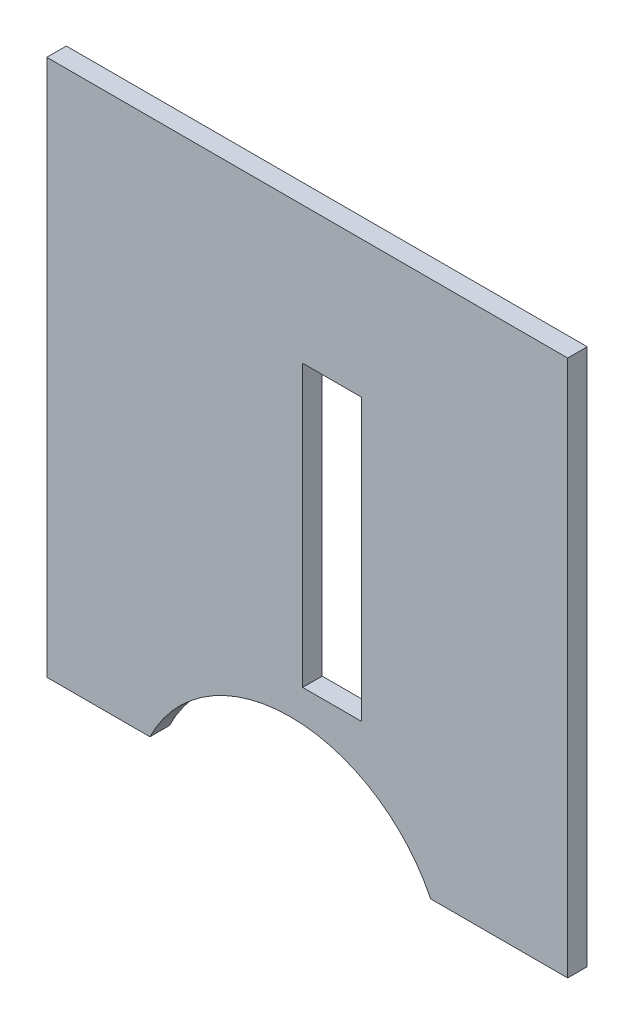
ISO-10303-21;
HEADER;
FILE_DESCRIPTION(('STEP AP214'),'2;1');
FILE_NAME('part.step','',(''),(''),'','','');
FILE_SCHEMA(('AUTOMOTIVE_DESIGN { 1 0 10303 214 1 1 1 1 }'));
ENDSEC;
DATA;
#1=APPLICATION_CONTEXT('core data for automotive mechanical design processes');
#2=APPLICATION_PROTOCOL_DEFINITION('international standard','automotive_design',2000,#1);
#3=PRODUCT_CONTEXT('',#1,'mechanical');
#4=PRODUCT('Part','Part','',(#3));
#5=PRODUCT_RELATED_PRODUCT_CATEGORY('part','',(#4));
#6=PRODUCT_DEFINITION_FORMATION('','',#4);
#7=PRODUCT_DEFINITION_CONTEXT('part definition',#1,'design');
#8=PRODUCT_DEFINITION('design','',#6,#7);
#9=PRODUCT_DEFINITION_SHAPE('','',#8);
#10=(LENGTH_UNIT() NAMED_UNIT(*) SI_UNIT(.MILLI.,.METRE.));
#11=(NAMED_UNIT(*) PLANE_ANGLE_UNIT() SI_UNIT($,.RADIAN.));
#12=(NAMED_UNIT(*) SI_UNIT($,.STERADIAN.) SOLID_ANGLE_UNIT());
#13=UNCERTAINTY_MEASURE_WITH_UNIT(LENGTH_MEASURE(1.E-05),#10,'distance_accuracy_value','');
#14=(GEOMETRIC_REPRESENTATION_CONTEXT(3) GLOBAL_UNCERTAINTY_ASSIGNED_CONTEXT((#13)) GLOBAL_UNIT_ASSIGNED_CONTEXT((#10,
#11,#12)) REPRESENTATION_CONTEXT('',''));
#15=CARTESIAN_POINT('',(0.,0.,0.));
#16=DIRECTION('',(0.,0.,1.));
#17=DIRECTION('',(1.,0.,0.));
#18=AXIS2_PLACEMENT_3D('',#15,#16,#17);
#19=CARTESIAN_POINT('',(0.,0.,-3.00000000000001));
#20=DIRECTION('',(-1.,0.,0.));
#21=DIRECTION('',(0.,-1.,0.));
#22=AXIS2_PLACEMENT_3D('',#19,#20,#21);
#23=PLANE('',#22);
#24=DIRECTION('',(0.,-1.,0.));
#25=VECTOR('',#24,1.);
#26=CARTESIAN_POINT('',(0.,0.,0.));
#27=LINE('',#26,#25);
#28=CARTESIAN_POINT('',(0.,0.,0.));
#29=VERTEX_POINT('',#28);
#30=CARTESIAN_POINT('',(0.,-82.4570091423777,0.));
#31=VERTEX_POINT('',#30);
#32=EDGE_CURVE('E143',#29,#31,#27,.T.);
#33=ORIENTED_EDGE('',*,*,#32,.F.);
#34=DIRECTION('',(0.,0.,1.));
#35=VECTOR('',#34,1.);
#36=CARTESIAN_POINT('',(0.,0.,-3.00000000000001));
#37=LINE('',#36,#35);
#38=CARTESIAN_POINT('',(0.,0.,-3.00000000000001));
#39=VERTEX_POINT('',#38);
#40=EDGE_CURVE('E11',#39,#29,#37,.T.);
#41=ORIENTED_EDGE('',*,*,#40,.F.);
#42=DIRECTION('',(0.,-1.,0.));
#43=VECTOR('',#42,1.);
#44=CARTESIAN_POINT('',(0.,0.,-3.00000000000001));
#45=LINE('',#44,#43);
#46=CARTESIAN_POINT('',(0.,-82.4570091423777,-3.00000000000001));
#47=VERTEX_POINT('',#46);
#48=EDGE_CURVE('E147',#39,#47,#45,.T.);
#49=ORIENTED_EDGE('',*,*,#48,.T.);
#50=DIRECTION('',(0.,0.,1.));
#51=VECTOR('',#50,1.);
#52=CARTESIAN_POINT('',(0.,-82.4570091423777,-3.00000000000001));
#53=LINE('',#52,#51);
#54=EDGE_CURVE('E36',#47,#31,#53,.T.);
#55=ORIENTED_EDGE('',*,*,#54,.T.);
#56=EDGE_LOOP('',(#33,#41,#49,#55));
#57=FACE_BOUND('',#56,.T.);
#58=ADVANCED_FACE('F33',(#57),#23,.T.);
#59=CARTESIAN_POINT('',(0.,0.,-3.00000000000001));
#60=DIRECTION('',(0.,1.,0.));
#61=DIRECTION('',(0.,0.,1.));
#62=AXIS2_PLACEMENT_3D('',#59,#60,#61);
#63=PLANE('',#62);
#64=DIRECTION('',(-1.,0.,0.));
#65=VECTOR('',#64,1.);
#66=CARTESIAN_POINT('',(0.,0.,0.));
#67=LINE('',#66,#65);
#68=CARTESIAN_POINT('',(80.,0.,0.));
#69=VERTEX_POINT('',#68);
#70=EDGE_CURVE('E151',#69,#29,#67,.T.);
#71=ORIENTED_EDGE('',*,*,#70,.F.);
#72=DIRECTION('',(0.,0.,1.));
#73=VECTOR('',#72,1.);
#74=CARTESIAN_POINT('',(80.,0.,-3.00000000000001));
#75=LINE('',#74,#73);
#76=CARTESIAN_POINT('',(80.,0.,-3.00000000000001));
#77=VERTEX_POINT('',#76);
#78=EDGE_CURVE('E41',#77,#69,#75,.T.);
#79=ORIENTED_EDGE('',*,*,#78,.F.);
#80=DIRECTION('',(-1.,0.,0.));
#81=VECTOR('',#80,1.);
#82=CARTESIAN_POINT('',(0.,0.,-3.00000000000001));
#83=LINE('',#82,#81);
#84=EDGE_CURVE('E163',#77,#39,#83,.T.);
#85=ORIENTED_EDGE('',*,*,#84,.T.);
#86=ORIENTED_EDGE('',*,*,#40,.T.);
#87=EDGE_LOOP('',(#71,#79,#85,#86));
#88=FACE_BOUND('',#87,.T.);
#89=ADVANCED_FACE('F200',(#88),#63,.T.);
#90=CARTESIAN_POINT('',(80.,0.,-3.00000000000001));
#91=DIRECTION('',(1.,0.,0.));
#92=DIRECTION('',(0.,1.,0.));
#93=AXIS2_PLACEMENT_3D('',#90,#91,#92);
#94=PLANE('',#93);
#95=DIRECTION('',(0.,1.,0.));
#96=VECTOR('',#95,1.);
#97=CARTESIAN_POINT('',(80.,0.,0.));
#98=LINE('',#97,#96);
#99=CARTESIAN_POINT('',(80.,-82.4570091423777,0.));
#100=VERTEX_POINT('',#99);
#101=EDGE_CURVE('E177',#100,#69,#98,.T.);
#102=ORIENTED_EDGE('',*,*,#101,.F.);
#103=DIRECTION('',(0.,0.,1.));
#104=VECTOR('',#103,1.);
#105=CARTESIAN_POINT('',(80.,-82.4570091423777,-3.00000000000001));
#106=LINE('',#105,#104);
#107=CARTESIAN_POINT('',(80.,-82.4570091423777,-3.00000000000001));
#108=VERTEX_POINT('',#107);
#109=EDGE_CURVE('E183',#108,#100,#106,.T.);
#110=ORIENTED_EDGE('',*,*,#109,.F.);
#111=DIRECTION('',(0.,1.,0.));
#112=VECTOR('',#111,1.);
#113=CARTESIAN_POINT('',(80.,0.,-3.00000000000001));
#114=LINE('',#113,#112);
#115=EDGE_CURVE('E160',#108,#77,#114,.T.);
#116=ORIENTED_EDGE('',*,*,#115,.T.);
#117=ORIENTED_EDGE('',*,*,#78,.T.);
#118=EDGE_LOOP('',(#102,#110,#116,#117));
#119=FACE_BOUND('',#118,.T.);
#120=ADVANCED_FACE('F211',(#119),#94,.T.);
#121=CARTESIAN_POINT('',(58.9568434609523,-82.4570091423777,-3.00000000000001));
#122=DIRECTION('',(0.,-1.,0.));
#123=DIRECTION('',(0.,0.,-1.));
#124=AXIS2_PLACEMENT_3D('',#121,#122,#123);
#125=PLANE('',#124);
#126=DIRECTION('',(1.,0.,0.));
#127=VECTOR('',#126,1.);
#128=CARTESIAN_POINT('',(58.9568434609523,-82.4570091423777,0.));
#129=LINE('',#128,#127);
#130=CARTESIAN_POINT('',(58.9568434609523,-82.4570091423777,0.));
#131=VERTEX_POINT('',#130);
#132=EDGE_CURVE('E174',#131,#100,#129,.T.);
#133=ORIENTED_EDGE('',*,*,#132,.F.);
#134=DIRECTION('',(0.,0.,1.));
#135=VECTOR('',#134,1.);
#136=CARTESIAN_POINT('',(58.9568434609523,-82.4570091423777,-3.00000000000001));
#137=LINE('',#136,#135);
#138=CARTESIAN_POINT('',(58.9568434609523,-82.4570091423777,-3.00000000000001));
#139=VERTEX_POINT('',#138);
#140=EDGE_CURVE('E185',#139,#131,#137,.T.);
#141=ORIENTED_EDGE('',*,*,#140,.F.);
#142=DIRECTION('',(1.,0.,0.));
#143=VECTOR('',#142,1.);
#144=CARTESIAN_POINT('',(58.9568434609523,-82.4570091423777,-3.00000000000001));
#145=LINE('',#144,#143);
#146=EDGE_CURVE('E157',#139,#108,#145,.T.);
#147=ORIENTED_EDGE('',*,*,#146,.T.);
#148=ORIENTED_EDGE('',*,*,#109,.T.);
#149=EDGE_LOOP('',(#133,#141,#147,#148));
#150=FACE_BOUND('',#149,.T.);
#151=ADVANCED_FACE('F209',(#150),#125,.T.);
#152=CARTESIAN_POINT('',(37.4,-93.0070091423777,-3.00000000000001));
#153=DIRECTION('',(0.,0.,1.));
#154=DIRECTION('',(1.,0.,0.));
#155=AXIS2_PLACEMENT_3D('',#152,#153,#154);
#156=CYLINDRICAL_SURFACE('',#155,24.);
#157=CARTESIAN_POINT('',(37.4,-93.0070091423777,0.));
#158=DIRECTION('',(0.,0.,-1.));
#159=DIRECTION('',(1.,0.,0.));
#160=AXIS2_PLACEMENT_3D('',#157,#158,#159);
#161=CIRCLE('',#160,24.);
#162=CARTESIAN_POINT('',(15.8431565390477,-82.4570091423777,0.));
#163=VERTEX_POINT('',#162);
#164=EDGE_CURVE('E171',#163,#131,#161,.T.);
#165=ORIENTED_EDGE('',*,*,#164,.F.);
#166=DIRECTION('',(0.,0.,1.));
#167=VECTOR('',#166,1.);
#168=CARTESIAN_POINT('',(15.8431565390477,-82.4570091423777,-3.00000000000001));
#169=LINE('',#168,#167);
#170=CARTESIAN_POINT('',(15.8431565390477,-82.4570091423777,-3.00000000000001));
#171=VERTEX_POINT('',#170);
#172=EDGE_CURVE('E186',#171,#163,#169,.T.);
#173=ORIENTED_EDGE('',*,*,#172,.F.);
#174=CARTESIAN_POINT('',(37.4,-93.0070091423777,-3.00000000000001));
#175=DIRECTION('',(0.,0.,-1.));
#176=DIRECTION('',(1.,0.,0.));
#177=AXIS2_PLACEMENT_3D('',#174,#175,#176);
#178=CIRCLE('',#177,24.);
#179=EDGE_CURVE('E154',#171,#139,#178,.T.);
#180=ORIENTED_EDGE('',*,*,#179,.T.);
#181=ORIENTED_EDGE('',*,*,#140,.T.);
#182=EDGE_LOOP('',(#165,#173,#180,#181));
#183=FACE_BOUND('',#182,.T.);
#184=ADVANCED_FACE('F206',(#183),#156,.F.);
#185=CARTESIAN_POINT('',(0.,-82.4570091423777,-3.00000000000001));
#186=DIRECTION('',(0.,-1.,0.));
#187=DIRECTION('',(0.,0.,-1.));
#188=AXIS2_PLACEMENT_3D('',#185,#186,#187);
#189=PLANE('',#188);
#190=DIRECTION('',(1.,0.,0.));
#191=VECTOR('',#190,1.);
#192=CARTESIAN_POINT('',(0.,-82.4570091423777,0.));
#193=LINE('',#192,#191);
#194=EDGE_CURVE('E168',#31,#163,#193,.T.);
#195=ORIENTED_EDGE('',*,*,#194,.F.);
#196=ORIENTED_EDGE('',*,*,#54,.F.);
#197=DIRECTION('',(1.,0.,0.));
#198=VECTOR('',#197,1.);
#199=CARTESIAN_POINT('',(0.,-82.4570091423777,-3.00000000000001));
#200=LINE('',#199,#198);
#201=EDGE_CURVE('E150',#47,#171,#200,.T.);
#202=ORIENTED_EDGE('',*,*,#201,.T.);
#203=ORIENTED_EDGE('',*,*,#172,.T.);
#204=EDGE_LOOP('',(#195,#196,#202,#203));
#205=FACE_BOUND('',#204,.T.);
#206=ADVANCED_FACE('F194',(#205),#189,.T.);
#207=CARTESIAN_POINT('',(37.4,-93.0070091423777,-3.00000000000001));
#208=DIRECTION('',(0.,0.,1.));
#209=DIRECTION('',(1.,0.,0.));
#210=AXIS2_PLACEMENT_3D('',#207,#208,#209);
#211=PLANE('',#210);
#212=DIRECTION('',(-1.,0.,0.));
#213=VECTOR('',#212,1.);
#214=CARTESIAN_POINT('',(39.3,-21.0431565390477,-3.00000000000001));
#215=LINE('',#214,#213);
#216=CARTESIAN_POINT('',(48.3,-21.0431565390477,-3.00000000000001));
#217=VERTEX_POINT('',#216);
#218=CARTESIAN_POINT('',(39.3,-21.0431565390477,-3.00000000000001));
#219=VERTEX_POINT('',#218);
#220=EDGE_CURVE('E118',#217,#219,#215,.T.);
#221=ORIENTED_EDGE('',*,*,#220,.T.);
#222=DIRECTION('',(0.,-1.,0.));
#223=VECTOR('',#222,1.);
#224=CARTESIAN_POINT('',(39.3,-21.0431565390477,-3.00000000000001));
#225=LINE('',#224,#223);
#226=CARTESIAN_POINT('',(39.3,-64.1568434609523,-3.00000000000001));
#227=VERTEX_POINT('',#226);
#228=EDGE_CURVE('E112',#219,#227,#225,.T.);
#229=ORIENTED_EDGE('',*,*,#228,.T.);
#230=DIRECTION('',(1.,0.,0.));
#231=VECTOR('',#230,1.);
#232=CARTESIAN_POINT('',(39.3,-64.1568434609523,-3.00000000000001));
#233=LINE('',#232,#231);
#234=CARTESIAN_POINT('',(48.3,-64.1568434609523,-3.00000000000001));
#235=VERTEX_POINT('',#234);
#236=EDGE_CURVE('E121',#227,#235,#233,.T.);
#237=ORIENTED_EDGE('',*,*,#236,.T.);
#238=DIRECTION('',(0.,1.,0.));
#239=VECTOR('',#238,1.);
#240=CARTESIAN_POINT('',(48.3,-21.0431565390477,-3.00000000000001));
#241=LINE('',#240,#239);
#242=EDGE_CURVE('E49',#235,#217,#241,.T.);
#243=ORIENTED_EDGE('',*,*,#242,.T.);
#244=EDGE_LOOP('',(#221,#229,#237,#243));
#245=FACE_BOUND('',#244,.T.);
#246=ORIENTED_EDGE('',*,*,#48,.F.);
#247=ORIENTED_EDGE('',*,*,#84,.F.);
#248=ORIENTED_EDGE('',*,*,#115,.F.);
#249=ORIENTED_EDGE('',*,*,#146,.F.);
#250=ORIENTED_EDGE('',*,*,#179,.F.);
#251=ORIENTED_EDGE('',*,*,#201,.F.);
#252=EDGE_LOOP('',(#246,#247,#248,#249,#250,#251));
#253=FACE_BOUND('',#252,.T.);
#254=ADVANCED_FACE('F125',(#245,#253),#211,.F.);
#255=CARTESIAN_POINT('',(37.4,-93.0070091423777,0.));
#256=DIRECTION('',(0.,0.,1.));
#257=DIRECTION('',(1.,0.,0.));
#258=AXIS2_PLACEMENT_3D('',#255,#256,#257);
#259=PLANE('',#258);
#260=DIRECTION('',(0.,-1.,0.));
#261=VECTOR('',#260,1.);
#262=CARTESIAN_POINT('',(39.3,-21.0431565390477,0.));
#263=LINE('',#262,#261);
#264=CARTESIAN_POINT('',(39.3,-21.0431565390477,0.));
#265=VERTEX_POINT('',#264);
#266=CARTESIAN_POINT('',(39.3,-64.1568434609523,0.));
#267=VERTEX_POINT('',#266);
#268=EDGE_CURVE('E57',#265,#267,#263,.T.);
#269=ORIENTED_EDGE('',*,*,#268,.F.);
#270=DIRECTION('',(-1.,0.,0.));
#271=VECTOR('',#270,1.);
#272=CARTESIAN_POINT('',(39.3,-21.0431565390477,0.));
#273=LINE('',#272,#271);
#274=CARTESIAN_POINT('',(48.3,-21.0431565390477,0.));
#275=VERTEX_POINT('',#274);
#276=EDGE_CURVE('E128',#275,#265,#273,.T.);
#277=ORIENTED_EDGE('',*,*,#276,.F.);
#278=DIRECTION('',(0.,1.,0.));
#279=VECTOR('',#278,1.);
#280=CARTESIAN_POINT('',(48.3,-21.0431565390477,0.));
#281=LINE('',#280,#279);
#282=CARTESIAN_POINT('',(48.3,-64.1568434609523,0.));
#283=VERTEX_POINT('',#282);
#284=EDGE_CURVE('E131',#283,#275,#281,.T.);
#285=ORIENTED_EDGE('',*,*,#284,.F.);
#286=DIRECTION('',(1.,0.,0.));
#287=VECTOR('',#286,1.);
#288=CARTESIAN_POINT('',(39.3,-64.1568434609523,0.));
#289=LINE('',#288,#287);
#290=EDGE_CURVE('E137',#267,#283,#289,.T.);
#291=ORIENTED_EDGE('',*,*,#290,.F.);
#292=EDGE_LOOP('',(#269,#277,#285,#291));
#293=FACE_BOUND('',#292,.T.);
#294=ORIENTED_EDGE('',*,*,#32,.T.);
#295=ORIENTED_EDGE('',*,*,#194,.T.);
#296=ORIENTED_EDGE('',*,*,#164,.T.);
#297=ORIENTED_EDGE('',*,*,#132,.T.);
#298=ORIENTED_EDGE('',*,*,#101,.T.);
#299=ORIENTED_EDGE('',*,*,#70,.T.);
#300=EDGE_LOOP('',(#294,#295,#296,#297,#298,#299));
#301=FACE_BOUND('',#300,.T.);
#302=ADVANCED_FACE('F196',(#293,#301),#259,.T.);
#303=CARTESIAN_POINT('',(39.3,-21.0431565390477,-3.00000000000001));
#304=DIRECTION('',(-1.,0.,0.));
#305=DIRECTION('',(0.,-1.,0.));
#306=AXIS2_PLACEMENT_3D('',#303,#304,#305);
#307=PLANE('',#306);
#308=ORIENTED_EDGE('',*,*,#268,.T.);
#309=DIRECTION('',(0.,0.,1.));
#310=VECTOR('',#309,1.);
#311=CARTESIAN_POINT('',(39.3,-64.1568434609523,-3.00000000000001));
#312=LINE('',#311,#310);
#313=EDGE_CURVE('E108',#227,#267,#312,.T.);
#314=ORIENTED_EDGE('',*,*,#313,.F.);
#315=ORIENTED_EDGE('',*,*,#228,.F.);
#316=DIRECTION('',(0.,0.,1.));
#317=VECTOR('',#316,1.);
#318=CARTESIAN_POINT('',(39.3,-21.0431565390477,-3.00000000000001));
#319=LINE('',#318,#317);
#320=EDGE_CURVE('E141',#219,#265,#319,.T.);
#321=ORIENTED_EDGE('',*,*,#320,.T.);
#322=EDGE_LOOP('',(#308,#314,#315,#321));
#323=FACE_BOUND('',#322,.T.);
#324=ADVANCED_FACE('F110',(#323),#307,.F.);
#325=CARTESIAN_POINT('',(39.3,-21.0431565390477,-3.00000000000001));
#326=DIRECTION('',(0.,1.,0.));
#327=DIRECTION('',(0.,0.,1.));
#328=AXIS2_PLACEMENT_3D('',#325,#326,#327);
#329=PLANE('',#328);
#330=ORIENTED_EDGE('',*,*,#276,.T.);
#331=ORIENTED_EDGE('',*,*,#320,.F.);
#332=ORIENTED_EDGE('',*,*,#220,.F.);
#333=DIRECTION('',(0.,0.,1.));
#334=VECTOR('',#333,1.);
#335=CARTESIAN_POINT('',(48.3,-21.0431565390477,-3.00000000000001));
#336=LINE('',#335,#334);
#337=EDGE_CURVE('E144',#217,#275,#336,.T.);
#338=ORIENTED_EDGE('',*,*,#337,.T.);
#339=EDGE_LOOP('',(#330,#331,#332,#338));
#340=FACE_BOUND('',#339,.T.);
#341=ADVANCED_FACE('F278',(#340),#329,.F.);
#342=CARTESIAN_POINT('',(48.3,-21.0431565390477,-3.00000000000001));
#343=DIRECTION('',(1.,0.,0.));
#344=DIRECTION('',(0.,1.,0.));
#345=AXIS2_PLACEMENT_3D('',#342,#343,#344);
#346=PLANE('',#345);
#347=ORIENTED_EDGE('',*,*,#284,.T.);
#348=ORIENTED_EDGE('',*,*,#337,.F.);
#349=ORIENTED_EDGE('',*,*,#242,.F.);
#350=DIRECTION('',(0.,0.,1.));
#351=VECTOR('',#350,1.);
#352=CARTESIAN_POINT('',(48.3,-64.1568434609523,-3.00000000000001));
#353=LINE('',#352,#351);
#354=EDGE_CURVE('E117',#235,#283,#353,.T.);
#355=ORIENTED_EDGE('',*,*,#354,.T.);
#356=EDGE_LOOP('',(#347,#348,#349,#355));
#357=FACE_BOUND('',#356,.T.);
#358=ADVANCED_FACE('F287',(#357),#346,.F.);
#359=CARTESIAN_POINT('',(39.3,-64.1568434609523,-3.00000000000001));
#360=DIRECTION('',(0.,-1.,0.));
#361=DIRECTION('',(0.,0.,-1.));
#362=AXIS2_PLACEMENT_3D('',#359,#360,#361);
#363=PLANE('',#362);
#364=ORIENTED_EDGE('',*,*,#290,.T.);
#365=ORIENTED_EDGE('',*,*,#354,.F.);
#366=ORIENTED_EDGE('',*,*,#236,.F.);
#367=ORIENTED_EDGE('',*,*,#313,.T.);
#368=EDGE_LOOP('',(#364,#365,#366,#367));
#369=FACE_BOUND('',#368,.T.);
#370=ADVANCED_FACE('F122',(#369),#363,.F.);
#371=CLOSED_SHELL('',(#58,#89,#120,#151,#184,#206,#254,#302,#324,#341,#358,#370));
#372=MANIFOLD_SOLID_BREP('B2',#371);
#373=ADVANCED_BREP_SHAPE_REPRESENTATION('',(#18,#372),#14);
#374=SHAPE_DEFINITION_REPRESENTATION(#9,#373);
ENDSEC;
END-ISO-10303-21;
